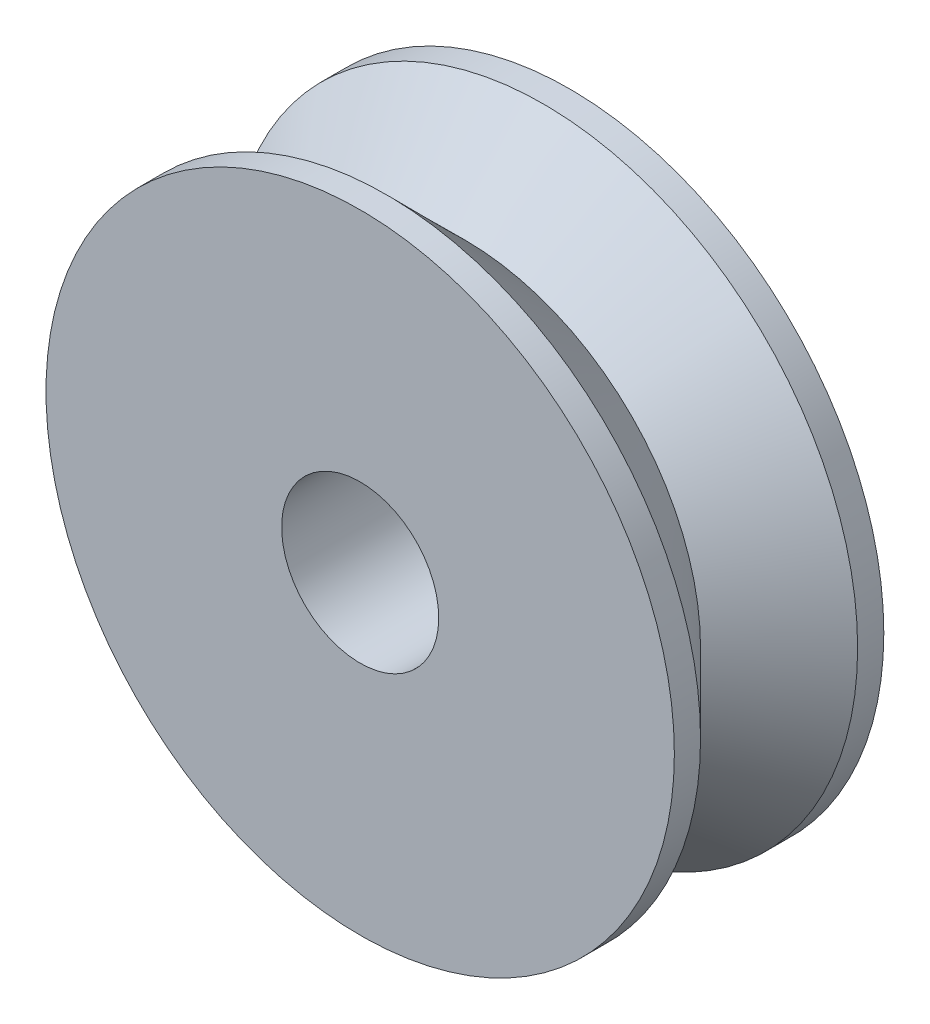
ISO-10303-21;
HEADER;
FILE_DESCRIPTION(('STEP AP214'),'2;1');
FILE_NAME('part.step','',(''),(''),'','','');
FILE_SCHEMA(('AUTOMOTIVE_DESIGN { 1 0 10303 214 1 1 1 1 }'));
ENDSEC;
DATA;
#1=APPLICATION_CONTEXT('core data for automotive mechanical design processes');
#2=APPLICATION_PROTOCOL_DEFINITION('international standard','automotive_design',2000,#1);
#3=PRODUCT_CONTEXT('',#1,'mechanical');
#4=PRODUCT('Part','Part','',(#3));
#5=PRODUCT_RELATED_PRODUCT_CATEGORY('part','',(#4));
#6=PRODUCT_DEFINITION_FORMATION('','',#4);
#7=PRODUCT_DEFINITION_CONTEXT('part definition',#1,'design');
#8=PRODUCT_DEFINITION('design','',#6,#7);
#9=PRODUCT_DEFINITION_SHAPE('','',#8);
#10=(LENGTH_UNIT() NAMED_UNIT(*) SI_UNIT(.MILLI.,.METRE.));
#11=(NAMED_UNIT(*) PLANE_ANGLE_UNIT() SI_UNIT($,.RADIAN.));
#12=(NAMED_UNIT(*) SI_UNIT($,.STERADIAN.) SOLID_ANGLE_UNIT());
#13=UNCERTAINTY_MEASURE_WITH_UNIT(LENGTH_MEASURE(1.E-05),#10,'distance_accuracy_value','');
#14=(GEOMETRIC_REPRESENTATION_CONTEXT(3) GLOBAL_UNCERTAINTY_ASSIGNED_CONTEXT((#13)) GLOBAL_UNIT_ASSIGNED_CONTEXT((#10,
#11,#12)) REPRESENTATION_CONTEXT('',''));
#15=CARTESIAN_POINT('',(0.,0.,0.));
#16=DIRECTION('',(0.,0.,1.));
#17=DIRECTION('',(1.,0.,0.));
#18=AXIS2_PLACEMENT_3D('',#15,#16,#17);
#19=CARTESIAN_POINT('',(0.,0.,0.));
#20=DIRECTION('',(0.,0.,1.));
#21=DIRECTION('',(1.,0.,0.));
#22=AXIS2_PLACEMENT_3D('',#19,#20,#21);
#23=PLANE('',#22);
#24=CARTESIAN_POINT('',(0.,0.,0.));
#25=DIRECTION('',(0.,0.,1.));
#26=DIRECTION('',(1.,0.,0.));
#27=AXIS2_PLACEMENT_3D('',#24,#25,#26);
#28=CIRCLE('',#27,5.99999999999908);
#29=CARTESIAN_POINT('',(5.99999999999908,0.,0.));
#30=VERTEX_POINT('',#29);
#31=EDGE_CURVE('E46',#30,#30,#28,.T.);
#32=ORIENTED_EDGE('',*,*,#31,.F.);
#33=EDGE_LOOP('',(#32));
#34=FACE_BOUND('',#33,.T.);
#35=CARTESIAN_POINT('',(0.,0.,0.));
#36=DIRECTION('',(0.,0.,1.));
#37=DIRECTION('',(1.,0.,0.));
#38=AXIS2_PLACEMENT_3D('',#35,#36,#37);
#39=CIRCLE('',#38,1.49999999999906);
#40=CARTESIAN_POINT('',(1.49999999999906,0.,0.));
#41=VERTEX_POINT('',#40);
#42=EDGE_CURVE('E51',#41,#41,#39,.T.);
#43=ORIENTED_EDGE('',*,*,#42,.T.);
#44=EDGE_LOOP('',(#43));
#45=FACE_BOUND('',#44,.T.);
#46=ADVANCED_FACE('F31',(#34,#45),#23,.F.);
#47=CARTESIAN_POINT('',(0.,0.,2.));
#48=DIRECTION('',(0.,0.,-1.));
#49=DIRECTION('',(-1.,0.,0.));
#50=AXIS2_PLACEMENT_3D('',#47,#48,#49);
#51=CYLINDRICAL_SURFACE('',#50,5.99999999999908);
#52=CARTESIAN_POINT('',(0.,0.,0.499999999999999));
#53=DIRECTION('',(0.,0.,1.));
#54=DIRECTION('',(1.,0.,0.));
#55=AXIS2_PLACEMENT_3D('',#52,#53,#54);
#56=CIRCLE('',#55,5.99999999999908);
#57=CARTESIAN_POINT('',(5.99999999999908,0.,0.499999999999999));
#58=VERTEX_POINT('',#57);
#59=EDGE_CURVE('E38',#58,#58,#56,.F.);
#60=ORIENTED_EDGE('',*,*,#59,.T.);
#61=EDGE_LOOP('',(#60));
#62=FACE_BOUND('',#61,.T.);
#63=ORIENTED_EDGE('',*,*,#31,.T.);
#64=EDGE_LOOP('',(#63));
#65=FACE_BOUND('',#64,.T.);
#66=ADVANCED_FACE('F76',(#62,#65),#51,.T.);
#67=CARTESIAN_POINT('',(0.,0.,2.));
#68=DIRECTION('',(0.,0.,-1.));
#69=DIRECTION('',(-1.,0.,0.));
#70=AXIS2_PLACEMENT_3D('',#67,#68,#69);
#71=CYLINDRICAL_SURFACE('',#70,1.49999999999906);
#72=ORIENTED_EDGE('',*,*,#42,.F.);
#73=EDGE_LOOP('',(#72));
#74=FACE_BOUND('',#73,.T.);
#75=CARTESIAN_POINT('',(0.,0.,4.));
#76=DIRECTION('',(0.,0.,1.));
#77=DIRECTION('',(1.,0.,0.));
#78=AXIS2_PLACEMENT_3D('',#75,#76,#77);
#79=CIRCLE('',#78,1.5);
#80=CARTESIAN_POINT('',(1.5,0.,4.));
#81=VERTEX_POINT('',#80);
#82=EDGE_CURVE('E57',#81,#81,#79,.T.);
#83=ORIENTED_EDGE('',*,*,#82,.T.);
#84=EDGE_LOOP('',(#83));
#85=FACE_BOUND('',#84,.T.);
#86=ADVANCED_FACE('F61',(#74,#85),#71,.F.);
#87=CARTESIAN_POINT('',(0.,0.,2.));
#88=DIRECTION('',(0.,0.,-1.));
#89=DIRECTION('',(-1.,0.,0.));
#90=AXIS2_PLACEMENT_3D('',#87,#88,#89);
#91=CONICAL_SURFACE('',#90,4.49999999999909,0.785398163397447);
#92=ORIENTED_EDGE('',*,*,#59,.F.);
#93=EDGE_LOOP('',(#92));
#94=FACE_BOUND('',#93,.T.);
#95=CARTESIAN_POINT('',(0.,0.,2.));
#96=DIRECTION('',(0.,0.,1.));
#97=DIRECTION('',(1.,0.,0.));
#98=AXIS2_PLACEMENT_3D('',#95,#96,#97);
#99=CIRCLE('',#98,4.49999999999909);
#100=CARTESIAN_POINT('',(4.49999999999909,0.,2.));
#101=VERTEX_POINT('',#100);
#102=EDGE_CURVE('E42',#101,#101,#99,.T.);
#103=ORIENTED_EDGE('',*,*,#102,.F.);
#104=EDGE_LOOP('',(#103));
#105=FACE_BOUND('',#104,.T.);
#106=ADVANCED_FACE('F66',(#94,#105),#91,.T.);
#107=CARTESIAN_POINT('',(0.,0.,4.));
#108=DIRECTION('',(0.,0.,1.));
#109=DIRECTION('',(1.,0.,0.));
#110=AXIS2_PLACEMENT_3D('',#107,#108,#109);
#111=PLANE('',#110);
#112=CARTESIAN_POINT('',(0.,0.,4.));
#113=DIRECTION('',(0.,0.,1.));
#114=DIRECTION('',(1.,0.,0.));
#115=AXIS2_PLACEMENT_3D('',#112,#113,#114);
#116=CIRCLE('',#115,5.99999999999908);
#117=CARTESIAN_POINT('',(5.99999999999908,0.,4.));
#118=VERTEX_POINT('',#117);
#119=EDGE_CURVE('E54',#118,#118,#116,.T.);
#120=ORIENTED_EDGE('',*,*,#119,.T.);
#121=EDGE_LOOP('',(#120));
#122=FACE_BOUND('',#121,.T.);
#123=ORIENTED_EDGE('',*,*,#82,.F.);
#124=EDGE_LOOP('',(#123));
#125=FACE_BOUND('',#124,.T.);
#126=ADVANCED_FACE('F63',(#122,#125),#111,.T.);
#127=CARTESIAN_POINT('',(0.,0.,4.));
#128=DIRECTION('',(0.,0.,-1.));
#129=DIRECTION('',(-1.,0.,0.));
#130=AXIS2_PLACEMENT_3D('',#127,#128,#129);
#131=CYLINDRICAL_SURFACE('',#130,5.99999999999908);
#132=CARTESIAN_POINT('',(0.,0.,3.5));
#133=DIRECTION('',(0.,0.,1.));
#134=DIRECTION('',(1.,0.,0.));
#135=AXIS2_PLACEMENT_3D('',#132,#133,#134);
#136=CIRCLE('',#135,5.99999999999908);
#137=CARTESIAN_POINT('',(5.99999999999908,0.,3.5));
#138=VERTEX_POINT('',#137);
#139=EDGE_CURVE('E10',#138,#138,#136,.T.);
#140=ORIENTED_EDGE('',*,*,#139,.T.);
#141=EDGE_LOOP('',(#140));
#142=FACE_BOUND('',#141,.T.);
#143=ORIENTED_EDGE('',*,*,#119,.F.);
#144=EDGE_LOOP('',(#143));
#145=FACE_BOUND('',#144,.T.);
#146=ADVANCED_FACE('F65',(#142,#145),#131,.T.);
#147=CARTESIAN_POINT('',(0.,0.,3.5));
#148=DIRECTION('',(0.,0.,1.));
#149=DIRECTION('',(1.,0.,0.));
#150=AXIS2_PLACEMENT_3D('',#147,#148,#149);
#151=CONICAL_SURFACE('',#150,5.99999999999908,0.785398163397451);
#152=ORIENTED_EDGE('',*,*,#102,.T.);
#153=EDGE_LOOP('',(#152));
#154=FACE_BOUND('',#153,.T.);
#155=ORIENTED_EDGE('',*,*,#139,.F.);
#156=EDGE_LOOP('',(#155));
#157=FACE_BOUND('',#156,.T.);
#158=ADVANCED_FACE('F33',(#154,#157),#151,.T.);
#159=CLOSED_SHELL('',(#46,#66,#86,#106,#126,#146,#158));
#160=MANIFOLD_SOLID_BREP('B2',#159);
#161=ADVANCED_BREP_SHAPE_REPRESENTATION('',(#18,#160),#14);
#162=SHAPE_DEFINITION_REPRESENTATION(#9,#161);
ENDSEC;
END-ISO-10303-21;
